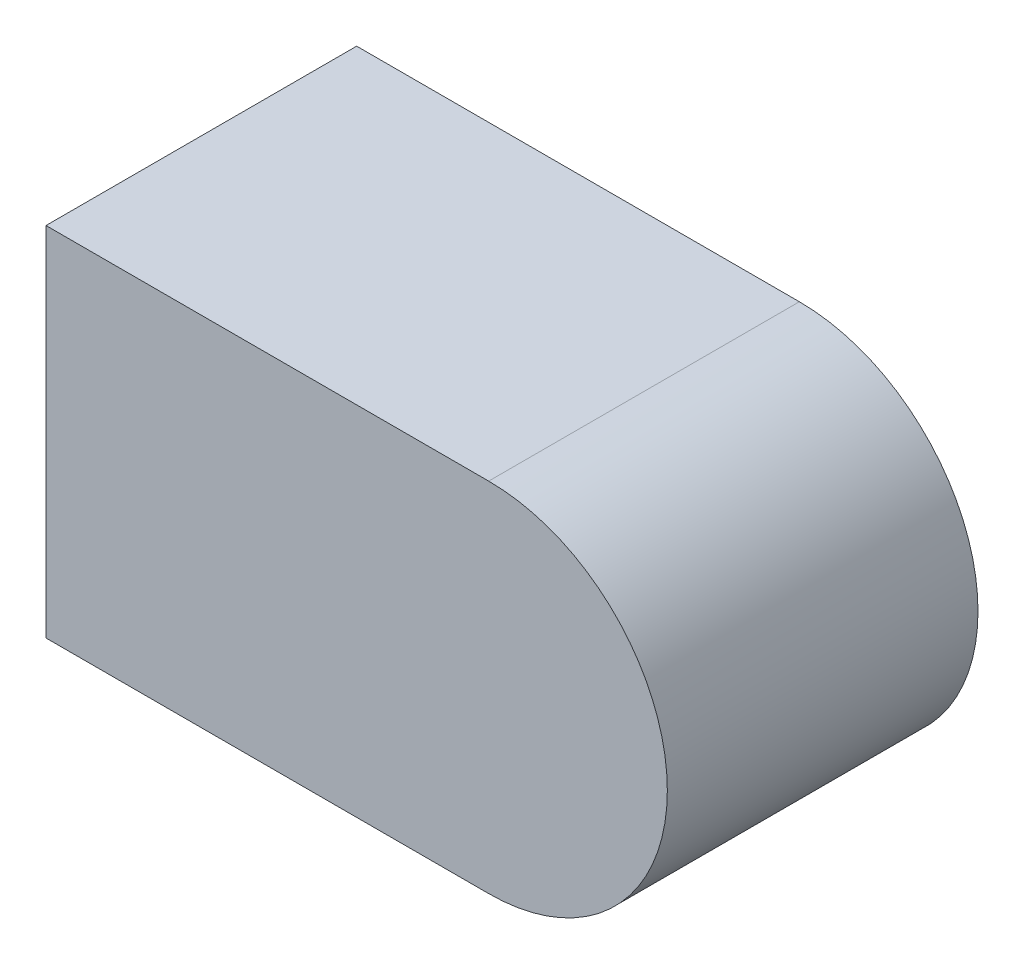
ISO-10303-21;
HEADER;
FILE_DESCRIPTION(('STEP AP214'),'2;1');
FILE_NAME('part.step','',(''),(''),'','','');
FILE_SCHEMA(('AUTOMOTIVE_DESIGN { 1 0 10303 214 1 1 1 1 }'));
ENDSEC;
DATA;
#1=APPLICATION_CONTEXT('core data for automotive mechanical design processes');
#2=APPLICATION_PROTOCOL_DEFINITION('international standard','automotive_design',2000,#1);
#3=PRODUCT_CONTEXT('',#1,'mechanical');
#4=PRODUCT('Part','Part','',(#3));
#5=PRODUCT_RELATED_PRODUCT_CATEGORY('part','',(#4));
#6=PRODUCT_DEFINITION_FORMATION('','',#4);
#7=PRODUCT_DEFINITION_CONTEXT('part definition',#1,'design');
#8=PRODUCT_DEFINITION('design','',#6,#7);
#9=PRODUCT_DEFINITION_SHAPE('','',#8);
#10=(LENGTH_UNIT() NAMED_UNIT(*) SI_UNIT(.MILLI.,.METRE.));
#11=(NAMED_UNIT(*) PLANE_ANGLE_UNIT() SI_UNIT($,.RADIAN.));
#12=(NAMED_UNIT(*) SI_UNIT($,.STERADIAN.) SOLID_ANGLE_UNIT());
#13=UNCERTAINTY_MEASURE_WITH_UNIT(LENGTH_MEASURE(1.E-05),#10,'distance_accuracy_value','');
#14=(GEOMETRIC_REPRESENTATION_CONTEXT(3) GLOBAL_UNCERTAINTY_ASSIGNED_CONTEXT((#13)) GLOBAL_UNIT_ASSIGNED_CONTEXT((#10,
#11,#12)) REPRESENTATION_CONTEXT('',''));
#15=CARTESIAN_POINT('',(0.,0.,0.));
#16=DIRECTION('',(0.,0.,1.));
#17=DIRECTION('',(1.,0.,0.));
#18=AXIS2_PLACEMENT_3D('',#15,#16,#17);
#19=CARTESIAN_POINT('',(-2.8335240809167,0.75,0.2));
#20=DIRECTION('',(0.,0.,1.));
#21=DIRECTION('',(1.,0.,0.));
#22=AXIS2_PLACEMENT_3D('',#19,#20,#21);
#23=PLANE('',#22);
#24=DIRECTION('',(-1.,0.,0.));
#25=VECTOR('',#24,1.);
#26=CARTESIAN_POINT('',(-2.715,0.865,0.2));
#27=LINE('',#26,#25);
#28=CARTESIAN_POINT('',(-2.715,0.865,0.2));
#29=VERTEX_POINT('',#28);
#30=CARTESIAN_POINT('',(-3.,0.865,0.2));
#31=VERTEX_POINT('',#30);
#32=EDGE_CURVE('E11',#29,#31,#27,.T.);
#33=ORIENTED_EDGE('',*,*,#32,.T.);
#34=DIRECTION('',(0.,-1.,0.));
#35=VECTOR('',#34,1.);
#36=CARTESIAN_POINT('',(-3.,1.875,0.2));
#37=LINE('',#36,#35);
#38=CARTESIAN_POINT('',(-3.,0.635,0.2));
#39=VERTEX_POINT('',#38);
#40=EDGE_CURVE('E24',#31,#39,#37,.T.);
#41=ORIENTED_EDGE('',*,*,#40,.T.);
#42=DIRECTION('',(1.,0.,0.));
#43=VECTOR('',#42,1.);
#44=CARTESIAN_POINT('',(-3.,0.635,0.2));
#45=LINE('',#44,#43);
#46=CARTESIAN_POINT('',(-2.715,0.635,0.2));
#47=VERTEX_POINT('',#46);
#48=EDGE_CURVE('E88',#39,#47,#45,.T.);
#49=ORIENTED_EDGE('',*,*,#48,.T.);
#50=CARTESIAN_POINT('',(-2.715,0.75,0.2));
#51=DIRECTION('',(0.,0.,1.));
#52=DIRECTION('',(0.,-1.,0.));
#53=AXIS2_PLACEMENT_3D('',#50,#51,#52);
#54=CIRCLE('',#53,0.115);
#55=EDGE_CURVE('E70',#47,#29,#54,.T.);
#56=ORIENTED_EDGE('',*,*,#55,.T.);
#57=EDGE_LOOP('',(#33,#41,#49,#56));
#58=FACE_BOUND('',#57,.T.);
#59=ADVANCED_FACE('F17',(#58),#23,.T.);
#60=CARTESIAN_POINT('',(-3.,3.,0.));
#61=DIRECTION('',(-1.,0.,0.));
#62=DIRECTION('',(0.,-1.,0.));
#63=AXIS2_PLACEMENT_3D('',#60,#61,#62);
#64=PLANE('',#63);
#65=DIRECTION('',(0.,0.,-1.));
#66=VECTOR('',#65,1.);
#67=CARTESIAN_POINT('',(-3.,0.635,0.));
#68=LINE('',#67,#66);
#69=CARTESIAN_POINT('',(-3.,0.635,0.));
#70=VERTEX_POINT('',#69);
#71=EDGE_CURVE('E76',#39,#70,#68,.T.);
#72=ORIENTED_EDGE('',*,*,#71,.F.);
#73=ORIENTED_EDGE('',*,*,#40,.F.);
#74=DIRECTION('',(0.,0.,1.));
#75=VECTOR('',#74,1.);
#76=CARTESIAN_POINT('',(-3.,0.865,0.));
#77=LINE('',#76,#75);
#78=CARTESIAN_POINT('',(-3.,0.865,0.));
#79=VERTEX_POINT('',#78);
#80=EDGE_CURVE('E84',#79,#31,#77,.T.);
#81=ORIENTED_EDGE('',*,*,#80,.F.);
#82=DIRECTION('',(0.,-1.,0.));
#83=VECTOR('',#82,1.);
#84=CARTESIAN_POINT('',(-3.,0.865,0.));
#85=LINE('',#84,#83);
#86=EDGE_CURVE('E82',#79,#70,#85,.T.);
#87=ORIENTED_EDGE('',*,*,#86,.T.);
#88=EDGE_LOOP('',(#72,#73,#81,#87));
#89=FACE_BOUND('',#88,.T.);
#90=ADVANCED_FACE('F90',(#89),#64,.T.);
#91=CARTESIAN_POINT('',(-2.715,0.865,0.));
#92=DIRECTION('',(0.,1.,0.));
#93=DIRECTION('',(-1.,0.,0.));
#94=AXIS2_PLACEMENT_3D('',#91,#92,#93);
#95=PLANE('',#94);
#96=DIRECTION('',(-1.,0.,0.));
#97=VECTOR('',#96,1.);
#98=CARTESIAN_POINT('',(-2.715,0.865,0.));
#99=LINE('',#98,#97);
#100=CARTESIAN_POINT('',(-2.715,0.865,0.));
#101=VERTEX_POINT('',#100);
#102=EDGE_CURVE('E61',#101,#79,#99,.T.);
#103=ORIENTED_EDGE('',*,*,#102,.T.);
#104=ORIENTED_EDGE('',*,*,#80,.T.);
#105=ORIENTED_EDGE('',*,*,#32,.F.);
#106=DIRECTION('',(0.,0.,1.));
#107=VECTOR('',#106,1.);
#108=CARTESIAN_POINT('',(-2.715,0.865,0.));
#109=LINE('',#108,#107);
#110=EDGE_CURVE('E64',#101,#29,#109,.T.);
#111=ORIENTED_EDGE('',*,*,#110,.F.);
#112=EDGE_LOOP('',(#103,#104,#105,#111));
#113=FACE_BOUND('',#112,.T.);
#114=ADVANCED_FACE('F91',(#113),#95,.T.);
#115=CARTESIAN_POINT('',(-2.715,0.75,0.));
#116=DIRECTION('',(0.,0.,1.));
#117=DIRECTION('',(0.,-1.,0.));
#118=AXIS2_PLACEMENT_3D('',#115,#116,#117);
#119=CYLINDRICAL_SURFACE('',#118,0.115);
#120=CARTESIAN_POINT('',(-2.715,0.75,0.));
#121=DIRECTION('',(0.,0.,1.));
#122=DIRECTION('',(0.,-1.,0.));
#123=AXIS2_PLACEMENT_3D('',#120,#121,#122);
#124=CIRCLE('',#123,0.115);
#125=CARTESIAN_POINT('',(-2.715,0.635,0.));
#126=VERTEX_POINT('',#125);
#127=EDGE_CURVE('E54',#126,#101,#124,.T.);
#128=ORIENTED_EDGE('',*,*,#127,.T.);
#129=ORIENTED_EDGE('',*,*,#110,.T.);
#130=ORIENTED_EDGE('',*,*,#55,.F.);
#131=DIRECTION('',(0.,0.,1.));
#132=VECTOR('',#131,1.);
#133=CARTESIAN_POINT('',(-2.715,0.635,0.));
#134=LINE('',#133,#132);
#135=EDGE_CURVE('E65',#126,#47,#134,.T.);
#136=ORIENTED_EDGE('',*,*,#135,.F.);
#137=EDGE_LOOP('',(#128,#129,#130,#136));
#138=FACE_BOUND('',#137,.T.);
#139=ADVANCED_FACE('F69',(#138),#119,.T.);
#140=CARTESIAN_POINT('',(-3.,0.635,0.));
#141=DIRECTION('',(0.,-1.,0.));
#142=DIRECTION('',(1.,0.,0.));
#143=AXIS2_PLACEMENT_3D('',#140,#141,#142);
#144=PLANE('',#143);
#145=DIRECTION('',(1.,0.,0.));
#146=VECTOR('',#145,1.);
#147=CARTESIAN_POINT('',(-3.,0.635,0.));
#148=LINE('',#147,#146);
#149=EDGE_CURVE('E59',#70,#126,#148,.T.);
#150=ORIENTED_EDGE('',*,*,#149,.T.);
#151=ORIENTED_EDGE('',*,*,#135,.T.);
#152=ORIENTED_EDGE('',*,*,#48,.F.);
#153=ORIENTED_EDGE('',*,*,#71,.T.);
#154=EDGE_LOOP('',(#150,#151,#152,#153));
#155=FACE_BOUND('',#154,.T.);
#156=ADVANCED_FACE('F74',(#155),#144,.T.);
#157=CARTESIAN_POINT('',(-2.8335265642716,0.75,0.));
#158=DIRECTION('',(0.,0.,1.));
#159=DIRECTION('',(1.,0.,0.));
#160=AXIS2_PLACEMENT_3D('',#157,#158,#159);
#161=PLANE('',#160);
#162=ORIENTED_EDGE('',*,*,#86,.F.);
#163=ORIENTED_EDGE('',*,*,#102,.F.);
#164=ORIENTED_EDGE('',*,*,#127,.F.);
#165=ORIENTED_EDGE('',*,*,#149,.F.);
#166=EDGE_LOOP('',(#162,#163,#164,#165));
#167=FACE_BOUND('',#166,.T.);
#168=ADVANCED_FACE('F57',(#167),#161,.F.);
#169=CLOSED_SHELL('',(#59,#90,#114,#139,#156,#168));
#170=MANIFOLD_SOLID_BREP('B1',#169);
#171=ADVANCED_BREP_SHAPE_REPRESENTATION('',(#18,#170),#14);
#172=SHAPE_DEFINITION_REPRESENTATION(#9,#171);
ENDSEC;
END-ISO-10303-21;
